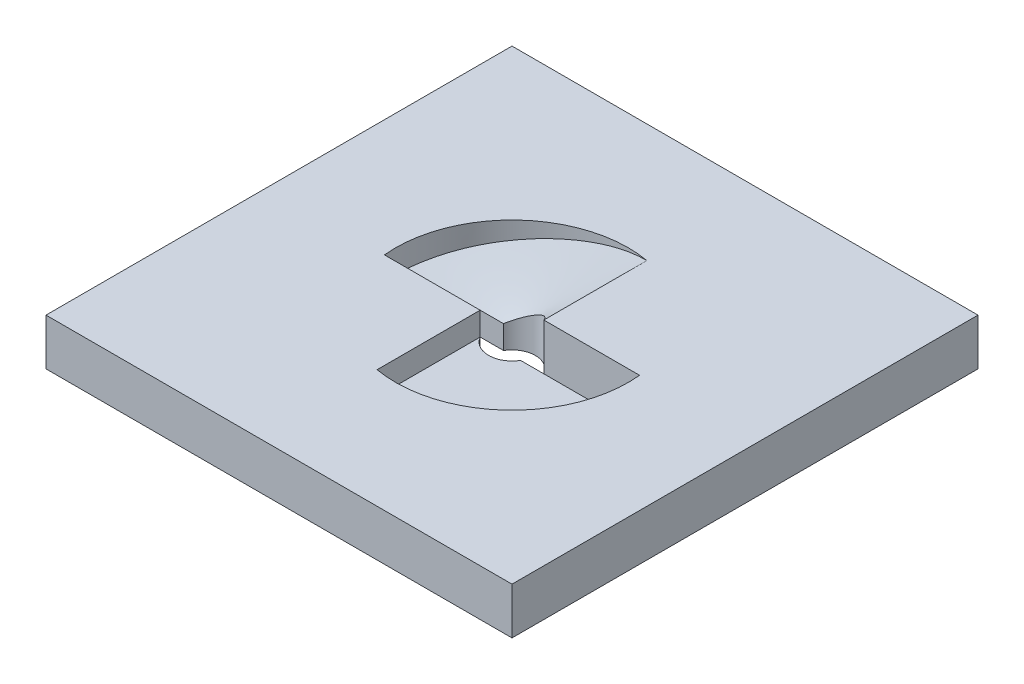
ISO-10303-21;
HEADER;
FILE_DESCRIPTION(('STEP AP214'),'2;1');
FILE_NAME('part.step','',(''),(''),'','','');
FILE_SCHEMA(('AUTOMOTIVE_DESIGN { 1 0 10303 214 1 1 1 1 }'));
ENDSEC;
DATA;
#1=APPLICATION_CONTEXT('core data for automotive mechanical design processes');
#2=APPLICATION_PROTOCOL_DEFINITION('international standard','automotive_design',2000,#1);
#3=PRODUCT_CONTEXT('',#1,'mechanical');
#4=PRODUCT('Part','Part','',(#3));
#5=PRODUCT_RELATED_PRODUCT_CATEGORY('part','',(#4));
#6=PRODUCT_DEFINITION_FORMATION('','',#4);
#7=PRODUCT_DEFINITION_CONTEXT('part definition',#1,'design');
#8=PRODUCT_DEFINITION('design','',#6,#7);
#9=PRODUCT_DEFINITION_SHAPE('','',#8);
#10=(LENGTH_UNIT() NAMED_UNIT(*) SI_UNIT(.MILLI.,.METRE.));
#11=(NAMED_UNIT(*) PLANE_ANGLE_UNIT() SI_UNIT($,.RADIAN.));
#12=(NAMED_UNIT(*) SI_UNIT($,.STERADIAN.) SOLID_ANGLE_UNIT());
#13=UNCERTAINTY_MEASURE_WITH_UNIT(LENGTH_MEASURE(1.E-05),#10,'distance_accuracy_value','');
#14=(GEOMETRIC_REPRESENTATION_CONTEXT(3) GLOBAL_UNCERTAINTY_ASSIGNED_CONTEXT((#13)) GLOBAL_UNIT_ASSIGNED_CONTEXT((#10,
#11,#12)) REPRESENTATION_CONTEXT('',''));
#15=CARTESIAN_POINT('',(0.,0.,0.));
#16=DIRECTION('',(0.,0.,1.));
#17=DIRECTION('',(1.,0.,0.));
#18=AXIS2_PLACEMENT_3D('',#15,#16,#17);
#19=CARTESIAN_POINT('',(24.8746859276655,0.,2.50000000000001));
#20=DIRECTION('',(0.,0.,1.));
#21=DIRECTION('',(1.,0.,0.));
#22=AXIS2_PLACEMENT_3D('',#19,#20,#21);
#23=PLANE('',#22);
#24=DIRECTION('',(-1.,0.,0.));
#25=VECTOR('',#24,1.);
#26=CARTESIAN_POINT('',(24.8746859276655,5.,2.50000000000001));
#27=LINE('',#26,#25);
#28=CARTESIAN_POINT('',(24.8746859276655,5.,2.50000000000001));
#29=VERTEX_POINT('',#28);
#30=CARTESIAN_POINT('',(4.33012701892221,5.,2.5));
#31=VERTEX_POINT('',#30);
#32=EDGE_CURVE('E264',#29,#31,#27,.T.);
#33=ORIENTED_EDGE('',*,*,#32,.F.);
#34=DIRECTION('',(0.,1.,0.));
#35=VECTOR('',#34,1.);
#36=CARTESIAN_POINT('',(24.8746859276655,0.,2.50000000000001));
#37=LINE('',#36,#35);
#38=CARTESIAN_POINT('',(24.8746859276655,0.,2.50000000000001));
#39=VERTEX_POINT('',#38);
#40=EDGE_CURVE('E309',#39,#29,#37,.T.);
#41=ORIENTED_EDGE('',*,*,#40,.F.);
#42=DIRECTION('',(1.,0.,0.));
#43=VECTOR('',#42,1.);
#44=CARTESIAN_POINT('',(24.8746859276655,0.,2.50000000000001));
#45=LINE('',#44,#43);
#46=CARTESIAN_POINT('',(4.33012701892221,0.,2.50000000000001));
#47=VERTEX_POINT('',#46);
#48=EDGE_CURVE('E300',#47,#39,#45,.T.);
#49=ORIENTED_EDGE('',*,*,#48,.F.);
#50=DIRECTION('',(0.,1.,0.));
#51=VECTOR('',#50,1.);
#52=CARTESIAN_POINT('',(4.33012701892221,0.,2.50000000000001));
#53=LINE('',#52,#51);
#54=EDGE_CURVE('E313',#47,#31,#53,.T.);
#55=ORIENTED_EDGE('',*,*,#54,.T.);
#56=EDGE_LOOP('',(#33,#41,#49,#55));
#57=FACE_BOUND('',#56,.T.);
#58=ADVANCED_FACE('F50',(#57),#23,.F.);
#59=CARTESIAN_POINT('',(0.,0.,0.));
#60=DIRECTION('',(0.,1.,0.));
#61=DIRECTION('',(0.,0.,1.));
#62=AXIS2_PLACEMENT_3D('',#59,#60,#61);
#63=CYLINDRICAL_SURFACE('',#62,5.);
#64=CARTESIAN_POINT('',(0.,5.,0.));
#65=DIRECTION('',(0.,1.,0.));
#66=DIRECTION('',(0.,0.,1.));
#67=AXIS2_PLACEMENT_3D('',#64,#65,#66);
#68=CIRCLE('',#67,5.);
#69=CARTESIAN_POINT('',(-4.33012701892218,5.,2.5));
#70=VERTEX_POINT('',#69);
#71=EDGE_CURVE('E12',#31,#70,#68,.F.);
#72=ORIENTED_EDGE('',*,*,#71,.F.);
#73=ORIENTED_EDGE('',*,*,#54,.F.);
#74=CARTESIAN_POINT('',(0.,0.,0.));
#75=DIRECTION('',(0.,1.,0.));
#76=DIRECTION('',(0.,0.,1.));
#77=AXIS2_PLACEMENT_3D('',#74,#75,#76);
#78=CIRCLE('',#77,5.);
#79=CARTESIAN_POINT('',(-4.33012701892218,0.,2.5));
#80=VERTEX_POINT('',#79);
#81=EDGE_CURVE('E297',#80,#47,#78,.T.);
#82=ORIENTED_EDGE('',*,*,#81,.F.);
#83=DIRECTION('',(0.,1.,0.));
#84=VECTOR('',#83,1.);
#85=CARTESIAN_POINT('',(-4.33012701892218,0.,2.5));
#86=LINE('',#85,#84);
#87=EDGE_CURVE('E316',#80,#70,#86,.T.);
#88=ORIENTED_EDGE('',*,*,#87,.T.);
#89=EDGE_LOOP('',(#72,#73,#82,#88));
#90=FACE_BOUND('',#89,.T.);
#91=ADVANCED_FACE('F476',(#90),#63,.F.);
#92=CARTESIAN_POINT('',(-4.33012701892218,0.,-2.49999999999999));
#93=DIRECTION('',(0.,0.,-1.));
#94=DIRECTION('',(-1.,0.,0.));
#95=AXIS2_PLACEMENT_3D('',#92,#93,#94);
#96=PLANE('',#95);
#97=DIRECTION('',(1.,0.,0.));
#98=VECTOR('',#97,1.);
#99=CARTESIAN_POINT('',(-24.8746859276655,5.,-2.49999999999999));
#100=LINE('',#99,#98);
#101=CARTESIAN_POINT('',(-24.8746859276655,5.,-2.49999999999999));
#102=VERTEX_POINT('',#101);
#103=CARTESIAN_POINT('',(-4.33012701892218,5.,-2.5));
#104=VERTEX_POINT('',#103);
#105=EDGE_CURVE('E190',#102,#104,#100,.T.);
#106=ORIENTED_EDGE('',*,*,#105,.F.);
#107=DIRECTION('',(0.,1.,0.));
#108=VECTOR('',#107,1.);
#109=CARTESIAN_POINT('',(-24.8746859276655,0.,-2.5));
#110=LINE('',#109,#108);
#111=CARTESIAN_POINT('',(-24.8746859276655,0.,-2.5));
#112=VERTEX_POINT('',#111);
#113=EDGE_CURVE('E321',#112,#102,#110,.T.);
#114=ORIENTED_EDGE('',*,*,#113,.F.);
#115=DIRECTION('',(-1.,0.,0.));
#116=VECTOR('',#115,1.);
#117=CARTESIAN_POINT('',(-4.33012701892218,0.,-2.49999999999999));
#118=LINE('',#117,#116);
#119=CARTESIAN_POINT('',(-4.33012701892218,0.,-2.49999999999999));
#120=VERTEX_POINT('',#119);
#121=EDGE_CURVE('E288',#120,#112,#118,.T.);
#122=ORIENTED_EDGE('',*,*,#121,.F.);
#123=DIRECTION('',(0.,1.,0.));
#124=VECTOR('',#123,1.);
#125=CARTESIAN_POINT('',(-4.33012701892218,0.,-2.49999999999999));
#126=LINE('',#125,#124);
#127=EDGE_CURVE('E396',#120,#104,#126,.T.);
#128=ORIENTED_EDGE('',*,*,#127,.T.);
#129=EDGE_LOOP('',(#106,#114,#122,#128));
#130=FACE_BOUND('',#129,.T.);
#131=ADVANCED_FACE('F375',(#130),#96,.F.);
#132=CARTESIAN_POINT('',(0.,0.,0.));
#133=DIRECTION('',(0.,1.,0.));
#134=DIRECTION('',(0.,0.,1.));
#135=AXIS2_PLACEMENT_3D('',#132,#133,#134);
#136=CYLINDRICAL_SURFACE('',#135,5.);
#137=DIRECTION('',(0.,1.,0.));
#138=VECTOR('',#137,1.);
#139=CARTESIAN_POINT('',(4.33012701892221,0.,-2.49999999999999));
#140=LINE('',#139,#138);
#141=CARTESIAN_POINT('',(4.33012701892221,0.,-2.49999999999999));
#142=VERTEX_POINT('',#141);
#143=CARTESIAN_POINT('',(4.3301270189222,10.,-2.5));
#144=VERTEX_POINT('',#143);
#145=EDGE_CURVE('E324',#142,#144,#140,.T.);
#146=ORIENTED_EDGE('',*,*,#145,.T.);
#147=CARTESIAN_POINT('',(2.66469387697522,9.03846172717959,-4.23076902489497));
#148=CARTESIAN_POINT('',(2.71201647111971,9.06578423095411,-4.20096695407878));
#149=CARTESIAN_POINT('',(2.75893505235169,9.092877795628,-4.17030890265555));
#150=CARTESIAN_POINT('',(2.8597173059455,9.15108161608739,-4.10199762314281));
#151=CARTESIAN_POINT('',(2.91342322156642,9.18210181302127,-4.06403461143927));
#152=CARTESIAN_POINT('',(3.02674133506856,9.24755699590658,-3.98051404339117));
#153=CARTESIAN_POINT('',(3.08616948339993,9.28188613031832,-3.93462390698361));
#154=CARTESIAN_POINT('',(3.22702578685333,9.3632492322429,-3.82066271475998));
#155=CARTESIAN_POINT('',(3.30758799677962,9.40978150048858,-3.75115172965387));
#156=CARTESIAN_POINT('',(3.43495058831338,9.48333598194429,-3.633934591223));
#157=CARTESIAN_POINT('',(3.48295783993006,9.5110588513575,-3.58796805872294));
#158=CARTESIAN_POINT('',(3.55013771851769,9.54984615250141,-3.52100587889694));
#159=CARTESIAN_POINT('',(3.56997338562836,9.56129764331009,-3.50089667312357));
#160=CARTESIAN_POINT('',(3.63946173080064,9.60140094932761,-3.42913563629135));
#161=CARTESIAN_POINT('',(3.68824865042857,9.62953214992196,-3.37634819292174));
#162=CARTESIAN_POINT('',(3.78274073221074,9.68403932733123,-3.26978154282066));
#163=CARTESIAN_POINT('',(3.82849161262608,9.71044114783264,-3.21605587466706));
#164=CARTESIAN_POINT('',(3.91686100254527,9.76143870251643,-3.10775101677127));
#165=CARTESIAN_POINT('',(3.95952898133712,9.78606294637963,-3.05322573432534));
#166=CARTESIAN_POINT('',(4.04175793844594,9.83352346540376,-2.9435814290528));
#167=CARTESIAN_POINT('',(4.08137069862592,9.85638949228409,-2.88851410474692));
#168=CARTESIAN_POINT('',(4.1574960432594,9.90033457994804,-2.77801361779177));
#169=CARTESIAN_POINT('',(4.19406359905576,9.92144530238931,-2.7226309826546));
#170=CARTESIAN_POINT('',(4.26410386043743,9.96188147346823,-2.61173440486431));
#171=CARTESIAN_POINT('',(4.29763526663986,9.98124077005096,-2.55626984469197));
#172=CARTESIAN_POINT('',(4.3301270189222,10.,-2.5));
#173=B_SPLINE_CURVE_WITH_KNOTS('',3,(#147,#148,#149,#150,#151,#152,#153,#154,#155,#156,#157,
#158,#159,#160,#161,#162,#163,#164,#165,#166,#167,#168,#169,#170,#171,#172),.UNSPECIFIED.,.F.,
.F.,(4,2,2,2,2,2,2,2,2,2,2,2,4),(0.,0.186723859821849,0.404823721043762,0.652433105686789,
1.00059122715136,1.21658325383816,1.30801676960532,1.53949876069109,1.76546925532878,
1.98585519864352,2.2005496365362,2.40941488775197,2.61228596922703),.UNSPECIFIED.);
#174=CARTESIAN_POINT('',(2.66469387697523,9.03846172717959,-4.23076902489498));
#175=VERTEX_POINT('',#174);
#176=EDGE_CURVE('E410',#144,#175,#173,.F.);
#177=ORIENTED_EDGE('',*,*,#176,.T.);
#178=CARTESIAN_POINT('',(0.,7.50000000000005,-4.99999999999999));
#179=CARTESIAN_POINT('',(0.077641100800136,7.54502894051611,-5.00038153963472));
#180=CARTESIAN_POINT('',(0.155295529280746,7.59004357796572,-4.99880806099145));
#181=CARTESIAN_POINT('',(0.310330057872768,7.67987279883182,-4.99184724183534));
#182=CARTESIAN_POINT('',(0.387710390770706,7.72468760401123,-4.98646797835986));
#183=CARTESIAN_POINT('',(0.541989321639058,7.81400020812547,-4.97201473445265));
#184=CARTESIAN_POINT('',(0.618888669131687,7.85849855732807,-4.96295209775802));
#185=CARTESIAN_POINT('',(0.772000011672761,7.94706319612295,-4.94124937814224));
#186=CARTESIAN_POINT('',(0.848213534083741,7.99113051144209,-4.92862424309555));
#187=CARTESIAN_POINT('',(0.999745913193733,8.07871467555184,-4.8999086547921));
#188=CARTESIAN_POINT('',(1.07506737372214,8.12223320682186,-4.88383704809309));
#189=CARTESIAN_POINT('',(1.2246089688976,8.20861136482232,-4.84836291279009));
#190=CARTESIAN_POINT('',(1.29883309563468,8.25147344810793,-4.82898321639336));
#191=CARTESIAN_POINT('',(1.44282080113774,8.33457599270169,-4.78784389737535));
#192=CARTESIAN_POINT('',(1.51261988151526,8.37483927480482,-4.76625454776219));
#193=CARTESIAN_POINT('',(1.65631883637297,8.45768304476946,-4.71832205829275));
#194=CARTESIAN_POINT('',(1.73016351639815,8.5002283096562,-4.69175186940232));
#195=CARTESIAN_POINT('',(1.88132949025462,8.58728354323841,-4.63328965621397));
#196=CARTESIAN_POINT('',(1.95858586812472,8.63175375747104,-4.60117104398461));
#197=CARTESIAN_POINT('',(2.13825702945594,8.73517794874509,-4.52115621622071));
#198=CARTESIAN_POINT('',(2.24013653484664,8.79382454072771,-4.47164407224014));
#199=CARTESIAN_POINT('',(2.41018234330231,8.89174921377044,-4.38161505801643));
#200=CARTESIAN_POINT('',(2.47911123522496,8.93145451351053,-4.34299220879572));
#201=CARTESIAN_POINT('',(2.58666657572019,8.99345313108483,-4.27925364549009));
#202=CARTESIAN_POINT('',(2.62582182820688,9.01603284456828,-4.2553048612224));
#203=CARTESIAN_POINT('',(2.66469387697522,9.03846172717959,-4.23076902489497));
#204=B_SPLINE_CURVE_WITH_KNOTS('',3,(#178,#179,#180,#181,#182,#183,#184,#185,#186,#187,#188,
#189,#190,#191,#192,#193,#194,#195,#196,#197,#198,#199,#200,#201,#202,#203),.UNSPECIFIED.,.F.,
.F.,(4,2,2,2,2,2,2,2,2,2,2,2,4),(0.,0.269236793043977,0.537903890866714,0.805749765856512,
1.07248808500348,1.33780337406321,1.60135649838329,1.85155989019279,2.11928786225258,
2.40345378397335,2.78585330859412,3.05105113546076,3.20449084127191),.UNSPECIFIED.);
#205=CARTESIAN_POINT('',(1.04614118198666E-13,7.50000000000005,-4.99999999999998));
#206=VERTEX_POINT('',#205);
#207=EDGE_CURVE('E179',#175,#206,#204,.F.);
#208=ORIENTED_EDGE('',*,*,#207,.T.);
#209=CARTESIAN_POINT('',(-2.66469381987522,5.9615383057871,-4.23076906085864));
#210=CARTESIAN_POINT('',(-2.62213431714754,5.98613608600261,-4.25761986270339));
#211=CARTESIAN_POINT('',(-2.57925296980721,6.01094995302502,-4.283762117572));
#212=CARTESIAN_POINT('',(-2.46812867054903,6.07530315274656,-4.3492118770725));
#213=CARTESIAN_POINT('',(-2.39943669491506,6.11513076700339,-4.38747699474603));
#214=CARTESIAN_POINT('',(-2.23418811284831,6.2109558430761,-4.47446963200018));
#215=CARTESIAN_POINT('',(-2.13700776561904,6.26732026999614,-4.52161247615482));
#216=CARTESIAN_POINT('',(-1.93764397772006,6.38290919804302,-4.61059488507811));
#217=CARTESIAN_POINT('',(-1.83539688150126,6.44216943067565,-4.65224504626992));
#218=CARTESIAN_POINT('',(-1.65802621570108,6.5448927599221,-4.71788697321277));
#219=CARTESIAN_POINT('',(-1.58337228699147,6.58810532216619,-4.74354862555331));
#220=CARTESIAN_POINT('',(-1.46369041026877,6.65721011719926,-4.78137530636382));
#221=CARTESIAN_POINT('',(-1.41898514884564,6.68298551543887,-4.79477928241667));
#222=CARTESIAN_POINT('',(-1.30014920774479,6.75135126983072,-4.82840104108803));
#223=CARTESIAN_POINT('',(-1.2257181827732,6.79401719794146,-4.84740748775672));
#224=CARTESIAN_POINT('',(-1.07588177626303,6.88005628966388,-4.88237884327327));
#225=CARTESIAN_POINT('',(-1.00047320600035,6.92343225775203,-4.89832295756074));
#226=CARTESIAN_POINT('',(-0.848779004472191,7.01070990764246,-4.9268617464752));
#227=CARTESIAN_POINT('',(-0.772490845324808,7.05461315535053,-4.93943832309776));
#228=CARTESIAN_POINT('',(-0.619256159008456,7.14284960312159,-4.96117134866003));
#229=CARTESIAN_POINT('',(-0.542308215558828,7.18718382668418,-4.97031362797632));
#230=CARTESIAN_POINT('',(-0.387939076444063,7.27616355101148,-4.98504425202584));
#231=CARTESIAN_POINT('',(-0.31051715342356,7.32080958714814,-4.99062180843157));
#232=CARTESIAN_POINT('',(-0.155395474246203,7.41029864888932,-4.99810195399945));
#233=CARTESIAN_POINT('',(-0.0776954750243295,7.45514189104159,-4.99999688604764));
#234=CARTESIAN_POINT('',(0.,7.50000000000005,-4.99999999999999));
#235=B_SPLINE_CURVE_WITH_KNOTS('',3,(#209,#210,#211,#212,#213,#214,#215,#216,#217,#218,#219,
#220,#221,#222,#223,#224,#225,#226,#227,#228,#229,#230,#231,#232,#233,#234),.UNSPECIFIED.,.F.,
.F.,(4,2,2,2,2,2,2,2,2,2,2,2,4),(0.,0.168030749987248,0.432371274701487,0.797654862639586,
1.17334758541931,1.44325043639105,1.60318065349655,1.86671988575498,2.13198986977316,
2.39865810135086,2.66641480468773,2.93497806069148,3.20409913316667),.UNSPECIFIED.);
#236=CARTESIAN_POINT('',(-2.66469381987522,5.9615383057871,-4.23076906085864));
#237=VERTEX_POINT('',#236);
#238=EDGE_CURVE('E171',#206,#237,#235,.F.);
#239=ORIENTED_EDGE('',*,*,#238,.T.);
#240=CARTESIAN_POINT('',(-4.33012701892218,5.,-2.49999999999999));
#241=CARTESIAN_POINT('',(-4.31365030625631,5.00952663961418,-2.52857886251552));
#242=CARTESIAN_POINT('',(-4.29690831611142,5.01921085126962,-2.55695220826712));
#243=CARTESIAN_POINT('',(-4.24442463925422,5.04957778314617,-2.64390087488356));
#244=CARTESIAN_POINT('',(-4.20781470637679,5.07077181089878,-2.70177595862716));
#245=CARTESIAN_POINT('',(-4.11115869879348,5.12672321074072,-2.84784307209986));
#246=CARTESIAN_POINT('',(-4.04956482953202,5.16237425922557,-2.9346756634256));
#247=CARTESIAN_POINT('',(-3.93205261887673,5.23037006348812,-3.08978327608383));
#248=CARTESIAN_POINT('',(-3.87684308277111,5.26230801669546,-3.1587778651518));
#249=CARTESIAN_POINT('',(-3.77600536240032,5.32060934453382,-3.27824560280895));
#250=CARTESIAN_POINT('',(-3.73099436215711,5.3466228178133,-3.32941122543735));
#251=CARTESIAN_POINT('',(-3.65341173708673,5.39140213299435,-3.41399151225074));
#252=CARTESIAN_POINT('',(-3.62131854438577,5.40990963165503,-3.44798375040561));
#253=CARTESIAN_POINT('',(-3.54411935844089,5.4543910900212,-3.52743973986551));
#254=CARTESIAN_POINT('',(-3.49864169135794,5.48056524385189,-3.57243146569054));
#255=CARTESIAN_POINT('',(-3.40538875052721,5.53427249052329,-3.66133072535676));
#256=CARTESIAN_POINT('',(-3.35758580499411,5.56182223438997,-3.70519910602332));
#257=CARTESIAN_POINT('',(-3.25964417850128,5.61827700215986,-3.79167515915462));
#258=CARTESIAN_POINT('',(-3.20947810102794,5.64719799416823,-3.8342413971618));
#259=CARTESIAN_POINT('',(-3.1068115204465,5.70640128152455,-3.91796694743798));
#260=CARTESIAN_POINT('',(-3.05428460049113,5.736699107307,-3.95908287000531));
#261=CARTESIAN_POINT('',(-2.94688680626773,5.79865935194772,-4.03975317898719));
#262=CARTESIAN_POINT('',(-2.89199022401474,5.83033684368137,-4.07926175269222));
#263=CARTESIAN_POINT('',(-2.77984620481831,5.89506041977192,-4.15656694937576));
#264=CARTESIAN_POINT('',(-2.72257379642875,5.92812114898806,-4.19431510065001));
#265=CARTESIAN_POINT('',(-2.66469381987522,5.9615383057871,-4.23076906085864));
#266=B_SPLINE_CURVE_WITH_KNOTS('',3,(#240,#241,#242,#243,#244,#245,#246,#247,#248,#249,#250,
#251,#252,#253,#254,#255,#256,#257,#258,#259,#260,#261,#262,#263,#264,#265),.UNSPECIFIED.,.F.,
.F.,(4,2,2,2,2,2,2,2,2,2,2,2,4),(0.,0.103007904803155,0.318000838307776,0.654546475323781,
0.93629529410469,1.15505878005877,1.30587736173679,1.51318491099862,1.72460059331123,
1.9401509444506,2.15988826425376,2.38389158635733,2.61226748486241),.UNSPECIFIED.);
#267=EDGE_CURVE('E175',#237,#104,#266,.F.);
#268=ORIENTED_EDGE('',*,*,#267,.T.);
#269=ORIENTED_EDGE('',*,*,#127,.F.);
#270=CARTESIAN_POINT('',(0.,0.,0.));
#271=DIRECTION('',(0.,1.,0.));
#272=DIRECTION('',(0.,0.,1.));
#273=AXIS2_PLACEMENT_3D('',#270,#271,#272);
#274=CIRCLE('',#273,5.);
#275=EDGE_CURVE('E285',#142,#120,#274,.T.);
#276=ORIENTED_EDGE('',*,*,#275,.F.);
#277=EDGE_LOOP('',(#146,#177,#208,#239,#268,#269,#276));
#278=FACE_BOUND('',#277,.T.);
#279=ADVANCED_FACE('F174',(#278),#136,.F.);
#280=CARTESIAN_POINT('',(50.,10.,50.));
#281=DIRECTION('',(-1.,0.,0.));
#282=DIRECTION('',(0.,0.,1.));
#283=AXIS2_PLACEMENT_3D('',#280,#281,#282);
#284=PLANE('',#283);
#285=DIRECTION('',(0.,0.,-1.));
#286=VECTOR('',#285,1.);
#287=CARTESIAN_POINT('',(50.,0.,50.));
#288=LINE('',#287,#286);
#289=CARTESIAN_POINT('',(50.,0.,50.));
#290=VERTEX_POINT('',#289);
#291=CARTESIAN_POINT('',(50.,0.,-50.));
#292=VERTEX_POINT('',#291);
#293=EDGE_CURVE('E312',#290,#292,#288,.T.);
#294=ORIENTED_EDGE('',*,*,#293,.T.);
#295=DIRECTION('',(0.,-1.,0.));
#296=VECTOR('',#295,1.);
#297=CARTESIAN_POINT('',(50.,10.,-50.));
#298=LINE('',#297,#296);
#299=CARTESIAN_POINT('',(50.,10.,-50.));
#300=VERTEX_POINT('',#299);
#301=EDGE_CURVE('E59',#300,#292,#298,.T.);
#302=ORIENTED_EDGE('',*,*,#301,.F.);
#303=DIRECTION('',(0.,0.,-1.));
#304=VECTOR('',#303,1.);
#305=CARTESIAN_POINT('',(50.,10.,50.));
#306=LINE('',#305,#304);
#307=CARTESIAN_POINT('',(50.,10.,50.));
#308=VERTEX_POINT('',#307);
#309=EDGE_CURVE('E325',#308,#300,#306,.T.);
#310=ORIENTED_EDGE('',*,*,#309,.F.);
#311=DIRECTION('',(0.,-1.,0.));
#312=VECTOR('',#311,1.);
#313=CARTESIAN_POINT('',(50.,10.,50.));
#314=LINE('',#313,#312);
#315=EDGE_CURVE('E335',#308,#290,#314,.T.);
#316=ORIENTED_EDGE('',*,*,#315,.T.);
#317=EDGE_LOOP('',(#294,#302,#310,#316));
#318=FACE_BOUND('',#317,.T.);
#319=ADVANCED_FACE('F52',(#318),#284,.F.);
#320=CARTESIAN_POINT('',(50.,10.,-50.));
#321=DIRECTION('',(0.,0.,1.));
#322=DIRECTION('',(1.,0.,0.));
#323=AXIS2_PLACEMENT_3D('',#320,#321,#322);
#324=PLANE('',#323);
#325=DIRECTION('',(-1.,0.,0.));
#326=VECTOR('',#325,1.);
#327=CARTESIAN_POINT('',(50.,0.,-50.));
#328=LINE('',#327,#326);
#329=CARTESIAN_POINT('',(-50.,0.,-50.));
#330=VERTEX_POINT('',#329);
#331=EDGE_CURVE('E338',#292,#330,#328,.T.);
#332=ORIENTED_EDGE('',*,*,#331,.T.);
#333=DIRECTION('',(0.,-1.,0.));
#334=VECTOR('',#333,1.);
#335=CARTESIAN_POINT('',(-50.,10.,-50.));
#336=LINE('',#335,#334);
#337=CARTESIAN_POINT('',(-50.,10.,-50.));
#338=VERTEX_POINT('',#337);
#339=EDGE_CURVE('E348',#338,#330,#336,.T.);
#340=ORIENTED_EDGE('',*,*,#339,.F.);
#341=DIRECTION('',(-1.,0.,0.));
#342=VECTOR('',#341,1.);
#343=CARTESIAN_POINT('',(50.,10.,-50.));
#344=LINE('',#343,#342);
#345=EDGE_CURVE('E328',#300,#338,#344,.T.);
#346=ORIENTED_EDGE('',*,*,#345,.F.);
#347=ORIENTED_EDGE('',*,*,#301,.T.);
#348=EDGE_LOOP('',(#332,#340,#346,#347));
#349=FACE_BOUND('',#348,.T.);
#350=ADVANCED_FACE('F467',(#349),#324,.F.);
#351=CARTESIAN_POINT('',(-50.,10.,50.));
#352=DIRECTION('',(1.,0.,0.));
#353=DIRECTION('',(0.,0.,-1.));
#354=AXIS2_PLACEMENT_3D('',#351,#352,#353);
#355=PLANE('',#354);
#356=DIRECTION('',(0.,0.,1.));
#357=VECTOR('',#356,1.);
#358=CARTESIAN_POINT('',(-50.,0.,50.));
#359=LINE('',#358,#357);
#360=CARTESIAN_POINT('',(-50.,0.,50.));
#361=VERTEX_POINT('',#360);
#362=EDGE_CURVE('E340',#330,#361,#359,.T.);
#363=ORIENTED_EDGE('',*,*,#362,.T.);
#364=DIRECTION('',(0.,-1.,0.));
#365=VECTOR('',#364,1.);
#366=CARTESIAN_POINT('',(-50.,10.,50.));
#367=LINE('',#366,#365);
#368=CARTESIAN_POINT('',(-50.,10.,50.));
#369=VERTEX_POINT('',#368);
#370=EDGE_CURVE('E345',#369,#361,#367,.T.);
#371=ORIENTED_EDGE('',*,*,#370,.F.);
#372=DIRECTION('',(0.,0.,1.));
#373=VECTOR('',#372,1.);
#374=CARTESIAN_POINT('',(-50.,10.,50.));
#375=LINE('',#374,#373);
#376=EDGE_CURVE('E331',#338,#369,#375,.T.);
#377=ORIENTED_EDGE('',*,*,#376,.F.);
#378=ORIENTED_EDGE('',*,*,#339,.T.);
#379=EDGE_LOOP('',(#363,#371,#377,#378));
#380=FACE_BOUND('',#379,.T.);
#381=ADVANCED_FACE('F464',(#380),#355,.F.);
#382=CARTESIAN_POINT('',(50.,10.,50.));
#383=DIRECTION('',(0.,0.,-1.));
#384=DIRECTION('',(-1.,0.,0.));
#385=AXIS2_PLACEMENT_3D('',#382,#383,#384);
#386=PLANE('',#385);
#387=DIRECTION('',(1.,0.,0.));
#388=VECTOR('',#387,1.);
#389=CARTESIAN_POINT('',(50.,0.,50.));
#390=LINE('',#389,#388);
#391=EDGE_CURVE('E329',#361,#290,#390,.T.);
#392=ORIENTED_EDGE('',*,*,#391,.T.);
#393=ORIENTED_EDGE('',*,*,#315,.F.);
#394=DIRECTION('',(1.,0.,0.));
#395=VECTOR('',#394,1.);
#396=CARTESIAN_POINT('',(50.,10.,50.));
#397=LINE('',#396,#395);
#398=EDGE_CURVE('E333',#369,#308,#397,.T.);
#399=ORIENTED_EDGE('',*,*,#398,.F.);
#400=ORIENTED_EDGE('',*,*,#370,.T.);
#401=EDGE_LOOP('',(#392,#393,#399,#400));
#402=FACE_BOUND('',#401,.T.);
#403=ADVANCED_FACE('F457',(#402),#386,.F.);
#404=CARTESIAN_POINT('',(0.,10.,0.));
#405=DIRECTION('',(0.,1.,0.));
#406=DIRECTION('',(0.,0.,1.));
#407=AXIS2_PLACEMENT_3D('',#404,#405,#406);
#408=PLANE('',#407);
#409=CARTESIAN_POINT('',(0.,10.,0.));
#410=DIRECTION('',(0.,1.,0.));
#411=DIRECTION('',(0.,0.,1.));
#412=AXIS2_PLACEMENT_3D('',#409,#410,#411);
#413=CIRCLE('',#412,25.);
#414=CARTESIAN_POINT('',(-4.33012701892218,10.,24.6221445044903));
#415=VERTEX_POINT('',#414);
#416=CARTESIAN_POINT('',(24.8746859276655,10.,-2.49999999999999));
#417=VERTEX_POINT('',#416);
#418=EDGE_CURVE('E276',#415,#417,#413,.T.);
#419=ORIENTED_EDGE('',*,*,#418,.F.);
#420=DIRECTION('',(0.,0.,1.));
#421=VECTOR('',#420,1.);
#422=CARTESIAN_POINT('',(-4.33012701892219,10.,2.5));
#423=LINE('',#422,#421);
#424=CARTESIAN_POINT('',(-4.33012701892219,10.,2.5));
#425=VERTEX_POINT('',#424);
#426=EDGE_CURVE('E265',#425,#415,#423,.T.);
#427=ORIENTED_EDGE('',*,*,#426,.F.);
#428=DIRECTION('',(1.,0.,0.));
#429=VECTOR('',#428,1.);
#430=CARTESIAN_POINT('',(-4.33012701892218,10.,2.50000000000001));
#431=LINE('',#430,#429);
#432=CARTESIAN_POINT('',(-24.8746859276655,10.,2.50000000000001));
#433=VERTEX_POINT('',#432);
#434=EDGE_CURVE('E282',#433,#425,#431,.T.);
#435=ORIENTED_EDGE('',*,*,#434,.F.);
#436=CARTESIAN_POINT('',(0.,10.,0.));
#437=DIRECTION('',(0.,1.,0.));
#438=DIRECTION('',(0.,0.,1.));
#439=AXIS2_PLACEMENT_3D('',#436,#437,#438);
#440=CIRCLE('',#439,25.);
#441=CARTESIAN_POINT('',(4.3301270189222,10.,-24.6221445044903));
#442=VERTEX_POINT('',#441);
#443=EDGE_CURVE('E308',#442,#433,#440,.T.);
#444=ORIENTED_EDGE('',*,*,#443,.F.);
#445=DIRECTION('',(0.,0.,-1.));
#446=VECTOR('',#445,1.);
#447=CARTESIAN_POINT('',(4.33012701892221,10.,-2.49999999999999));
#448=LINE('',#447,#446);
#449=EDGE_CURVE('E509',#144,#442,#448,.T.);
#450=ORIENTED_EDGE('',*,*,#449,.F.);
#451=DIRECTION('',(-1.,0.,0.));
#452=VECTOR('',#451,1.);
#453=CARTESIAN_POINT('',(24.8746859276655,10.,-2.49999999999999));
#454=LINE('',#453,#452);
#455=EDGE_CURVE('E305',#417,#144,#454,.T.);
#456=ORIENTED_EDGE('',*,*,#455,.F.);
#457=EDGE_LOOP('',(#419,#427,#435,#444,#450,#456));
#458=FACE_BOUND('',#457,.T.);
#459=ORIENTED_EDGE('',*,*,#309,.T.);
#460=ORIENTED_EDGE('',*,*,#345,.T.);
#461=ORIENTED_EDGE('',*,*,#376,.T.);
#462=ORIENTED_EDGE('',*,*,#398,.T.);
#463=EDGE_LOOP('',(#459,#460,#461,#462));
#464=FACE_BOUND('',#463,.T.);
#465=ADVANCED_FACE('F454',(#458,#464),#408,.T.);
#466=CARTESIAN_POINT('',(0.,0.,0.));
#467=DIRECTION('',(0.,1.,0.));
#468=DIRECTION('',(0.,0.,1.));
#469=AXIS2_PLACEMENT_3D('',#466,#467,#468);
#470=PLANE('',#469);
#471=ORIENTED_EDGE('',*,*,#48,.T.);
#472=CARTESIAN_POINT('',(0.,0.,0.));
#473=DIRECTION('',(0.,1.,0.));
#474=DIRECTION('',(0.,0.,1.));
#475=AXIS2_PLACEMENT_3D('',#472,#473,#474);
#476=CIRCLE('',#475,25.);
#477=CARTESIAN_POINT('',(24.8746859276655,0.,-2.49999999999999));
#478=VERTEX_POINT('',#477);
#479=EDGE_CURVE('E278',#39,#478,#476,.T.);
#480=ORIENTED_EDGE('',*,*,#479,.T.);
#481=DIRECTION('',(-1.,0.,0.));
#482=VECTOR('',#481,1.);
#483=CARTESIAN_POINT('',(24.8746859276655,0.,-2.49999999999999));
#484=LINE('',#483,#482);
#485=EDGE_CURVE('E281',#478,#142,#484,.T.);
#486=ORIENTED_EDGE('',*,*,#485,.T.);
#487=ORIENTED_EDGE('',*,*,#275,.T.);
#488=ORIENTED_EDGE('',*,*,#121,.T.);
#489=CARTESIAN_POINT('',(0.,0.,0.));
#490=DIRECTION('',(0.,1.,0.));
#491=DIRECTION('',(0.,0.,1.));
#492=AXIS2_PLACEMENT_3D('',#489,#490,#491);
#493=CIRCLE('',#492,25.);
#494=CARTESIAN_POINT('',(-24.8746859276655,0.,2.50000000000001));
#495=VERTEX_POINT('',#494);
#496=EDGE_CURVE('E291',#112,#495,#493,.T.);
#497=ORIENTED_EDGE('',*,*,#496,.T.);
#498=DIRECTION('',(1.,0.,0.));
#499=VECTOR('',#498,1.);
#500=CARTESIAN_POINT('',(-4.33012701892218,0.,2.50000000000001));
#501=LINE('',#500,#499);
#502=EDGE_CURVE('E294',#495,#80,#501,.T.);
#503=ORIENTED_EDGE('',*,*,#502,.T.);
#504=ORIENTED_EDGE('',*,*,#81,.T.);
#505=EDGE_LOOP('',(#471,#480,#486,#487,#488,#497,#503,#504));
#506=FACE_BOUND('',#505,.T.);
#507=ORIENTED_EDGE('',*,*,#293,.F.);
#508=ORIENTED_EDGE('',*,*,#391,.F.);
#509=ORIENTED_EDGE('',*,*,#362,.F.);
#510=ORIENTED_EDGE('',*,*,#331,.F.);
#511=EDGE_LOOP('',(#507,#508,#509,#510));
#512=FACE_BOUND('',#511,.T.);
#513=ADVANCED_FACE('F452',(#506,#512),#470,.F.);
#514=CARTESIAN_POINT('',(0.,0.,0.));
#515=DIRECTION('',(0.,1.,0.));
#516=DIRECTION('',(0.,0.,1.));
#517=AXIS2_PLACEMENT_3D('',#514,#515,#516);
#518=CYLINDRICAL_SURFACE('',#517,25.);
#519=ORIENTED_EDGE('',*,*,#418,.T.);
#520=DIRECTION('',(0.,1.,0.));
#521=VECTOR('',#520,1.);
#522=CARTESIAN_POINT('',(24.8746859276655,0.,-2.49999999999999));
#523=LINE('',#522,#521);
#524=EDGE_CURVE('E303',#478,#417,#523,.T.);
#525=ORIENTED_EDGE('',*,*,#524,.F.);
#526=ORIENTED_EDGE('',*,*,#479,.F.);
#527=ORIENTED_EDGE('',*,*,#40,.T.);
#528=CARTESIAN_POINT('',(0.,5.,0.));
#529=DIRECTION('',(0.,1.,0.));
#530=DIRECTION('',(0.,0.,1.));
#531=AXIS2_PLACEMENT_3D('',#528,#529,#530);
#532=CIRCLE('',#531,25.);
#533=CARTESIAN_POINT('',(-4.33012701892218,5.,24.6221445044903));
#534=VERTEX_POINT('',#533);
#535=EDGE_CURVE('E257',#534,#29,#532,.T.);
#536=ORIENTED_EDGE('',*,*,#535,.F.);
#537=DIRECTION('',(0.,1.,0.));
#538=VECTOR('',#537,1.);
#539=CARTESIAN_POINT('',(-4.33012701892218,5.,24.6221445044903));
#540=LINE('',#539,#538);
#541=EDGE_CURVE('E273',#534,#415,#540,.T.);
#542=ORIENTED_EDGE('',*,*,#541,.T.);
#543=EDGE_LOOP('',(#519,#525,#526,#527,#536,#542));
#544=FACE_BOUND('',#543,.T.);
#545=ADVANCED_FACE('F449',(#544),#518,.F.);
#546=CARTESIAN_POINT('',(-4.33012701892218,0.,2.50000000000001));
#547=DIRECTION('',(0.,0.,1.));
#548=DIRECTION('',(1.,0.,0.));
#549=AXIS2_PLACEMENT_3D('',#546,#547,#548);
#550=PLANE('',#549);
#551=ORIENTED_EDGE('',*,*,#434,.T.);
#552=DIRECTION('',(0.,1.,0.));
#553=VECTOR('',#552,1.);
#554=CARTESIAN_POINT('',(-4.33012701892219,5.,2.5));
#555=LINE('',#554,#553);
#556=EDGE_CURVE('E270',#70,#425,#555,.T.);
#557=ORIENTED_EDGE('',*,*,#556,.F.);
#558=ORIENTED_EDGE('',*,*,#87,.F.);
#559=ORIENTED_EDGE('',*,*,#502,.F.);
#560=DIRECTION('',(0.,1.,0.));
#561=VECTOR('',#560,1.);
#562=CARTESIAN_POINT('',(-24.8746859276655,0.,2.50000000000001));
#563=LINE('',#562,#561);
#564=EDGE_CURVE('E319',#495,#433,#563,.T.);
#565=ORIENTED_EDGE('',*,*,#564,.T.);
#566=EDGE_LOOP('',(#551,#557,#558,#559,#565));
#567=FACE_BOUND('',#566,.T.);
#568=ADVANCED_FACE('F373',(#567),#550,.F.);
#569=CARTESIAN_POINT('',(0.,0.,0.));
#570=DIRECTION('',(0.,1.,0.));
#571=DIRECTION('',(0.,0.,1.));
#572=AXIS2_PLACEMENT_3D('',#569,#570,#571);
#573=CYLINDRICAL_SURFACE('',#572,25.);
#574=ORIENTED_EDGE('',*,*,#113,.T.);
#575=CARTESIAN_POINT('',(4.3301270189222,10.,-24.6221445044903));
#576=CARTESIAN_POINT('',(1.32314317407007,9.48519036051497,-25.1509620487818));
#577=CARTESIAN_POINT('',(-2.04441072821273,8.90864944781649,-25.1565593822649));
#578=CARTESIAN_POINT('',(-8.81623571249382,7.7492814702393,-23.6496529158633));
#579=CARTESIAN_POINT('',(-12.1988192251611,7.1701674182415,-22.122203423978));
#580=CARTESIAN_POINT('',(-17.9917120426449,6.17839718706789,-17.7341865501231));
#581=CARTESIAN_POINT('',(-20.3781681373674,5.76982478855826,-14.891687565358));
#582=CARTESIAN_POINT('',(-23.6627418027322,5.20749047890665,-8.78104467340225));
#583=CARTESIAN_POINT('',(-24.5693729761166,5.05227099932249,-5.53782551177134));
#584=CARTESIAN_POINT('',(-24.8746859276655,5.,-2.50000000000002));
#585=B_SPLINE_CURVE_WITH_KNOTS('',3,(#575,#576,#577,#578,#579,#580,#581,#582,#583,#584),
.UNSPECIFIED.,.F.,.F.,(4,2,2,2,4),(0.,0.25,0.5,0.75,1.),.UNSPECIFIED.);
#586=CARTESIAN_POINT('',(-22.0204551093149,5.48865760988961,-11.8363658602902));
#587=VERTEX_POINT('',#586);
#588=EDGE_CURVE('E192',#102,#587,#585,.F.);
#589=ORIENTED_EDGE('',*,*,#588,.T.);
#590=CARTESIAN_POINT('',(4.3301270189222,10.,-24.6221445044903));
#591=CARTESIAN_POINT('',(1.32314317407007,9.48519036051497,-25.1509620487818));
#592=CARTESIAN_POINT('',(-2.04441072821273,8.90864944781649,-25.1565593822649));
#593=CARTESIAN_POINT('',(-8.81623571249382,7.7492814702393,-23.6496529158633));
#594=CARTESIAN_POINT('',(-12.1988192251611,7.1701674182415,-22.122203423978));
#595=CARTESIAN_POINT('',(-17.9917120426449,6.17839718706789,-17.7341865501231));
#596=CARTESIAN_POINT('',(-20.3781681373674,5.76982478855826,-14.891687565358));
#597=CARTESIAN_POINT('',(-23.6627418027322,5.20749047890665,-8.78104467340225));
#598=CARTESIAN_POINT('',(-24.5693729761166,5.05227099932249,-5.53782551177134));
#599=CARTESIAN_POINT('',(-24.8746859276655,5.,-2.50000000000002));
#600=B_SPLINE_CURVE_WITH_KNOTS('',3,(#590,#591,#592,#593,#594,#595,#596,#597,#598,#599),
.UNSPECIFIED.,.F.,.F.,(4,2,2,2,4),(0.,0.25,0.5,0.75,1.),.UNSPECIFIED.);
#601=CARTESIAN_POINT('',(-15.0952656339027,6.67428230265475,-19.9281949870508));
#602=VERTEX_POINT('',#601);
#603=EDGE_CURVE('E73',#587,#602,#600,.F.);
#604=ORIENTED_EDGE('',*,*,#603,.T.);
#605=CARTESIAN_POINT('',(4.3301270189222,10.,-24.6221445044903));
#606=CARTESIAN_POINT('',(1.32314317407007,9.48519036051497,-25.1509620487818));
#607=CARTESIAN_POINT('',(-2.04441072821273,8.90864944781649,-25.1565593822649));
#608=CARTESIAN_POINT('',(-8.81623571249382,7.7492814702393,-23.6496529158633));
#609=CARTESIAN_POINT('',(-12.1988192251611,7.1701674182415,-22.122203423978));
#610=CARTESIAN_POINT('',(-17.9917120426449,6.17839718706789,-17.7341865501231));
#611=CARTESIAN_POINT('',(-20.3781681373674,5.76982478855826,-14.891687565358));
#612=CARTESIAN_POINT('',(-23.6627418027322,5.20749047890665,-8.78104467340225));
#613=CARTESIAN_POINT('',(-24.5693729761166,5.05227099932249,-5.53782551177134));
#614=CARTESIAN_POINT('',(-24.8746859276655,5.,-2.50000000000002));
#615=B_SPLINE_CURVE_WITH_KNOTS('',3,(#605,#606,#607,#608,#609,#610,#611,#612,#613,#614),
.UNSPECIFIED.,.F.,.F.,(4,2,2,2,4),(0.,0.25,0.5,0.75,1.),.UNSPECIFIED.);
#616=CARTESIAN_POINT('',(-5.43032282793591,8.32896552621158,-24.4031062363872));
#617=VERTEX_POINT('',#616);
#618=EDGE_CURVE('E67',#602,#617,#615,.F.);
#619=ORIENTED_EDGE('',*,*,#618,.T.);
#620=CARTESIAN_POINT('',(4.3301270189222,10.,-24.6221445044903));
#621=CARTESIAN_POINT('',(1.32314317407007,9.48519036051497,-25.1509620487818));
#622=CARTESIAN_POINT('',(-2.04441072821273,8.90864944781649,-25.1565593822649));
#623=CARTESIAN_POINT('',(-8.81623571249382,7.7492814702393,-23.6496529158633));
#624=CARTESIAN_POINT('',(-12.1988192251611,7.1701674182415,-22.122203423978));
#625=CARTESIAN_POINT('',(-17.9917120426449,6.17839718706789,-17.7341865501231));
#626=CARTESIAN_POINT('',(-20.3781681373674,5.76982478855826,-14.891687565358));
#627=CARTESIAN_POINT('',(-23.6627418027322,5.20749047890665,-8.78104467340225));
#628=CARTESIAN_POINT('',(-24.5693729761166,5.05227099932249,-5.53782551177134));
#629=CARTESIAN_POINT('',(-24.8746859276655,5.,-2.50000000000002));
#630=B_SPLINE_CURVE_WITH_KNOTS('',3,(#620,#621,#622,#623,#624,#625,#626,#627,#628,#629),
.UNSPECIFIED.,.F.,.F.,(4,2,2,2,4),(0.,0.25,0.5,0.75,1.),.UNSPECIFIED.);
#631=EDGE_CURVE('E355',#617,#442,#630,.F.);
#632=ORIENTED_EDGE('',*,*,#631,.T.);
#633=ORIENTED_EDGE('',*,*,#443,.T.);
#634=ORIENTED_EDGE('',*,*,#564,.F.);
#635=ORIENTED_EDGE('',*,*,#496,.F.);
#636=EDGE_LOOP('',(#574,#589,#604,#619,#632,#633,#634,#635));
#637=FACE_BOUND('',#636,.T.);
#638=ADVANCED_FACE('F362',(#637),#573,.F.);
#639=CARTESIAN_POINT('',(24.8746859276655,0.,-2.49999999999999));
#640=DIRECTION('',(0.,0.,-1.));
#641=DIRECTION('',(-1.,0.,0.));
#642=AXIS2_PLACEMENT_3D('',#639,#640,#641);
#643=PLANE('',#642);
#644=ORIENTED_EDGE('',*,*,#455,.T.);
#645=ORIENTED_EDGE('',*,*,#145,.F.);
#646=ORIENTED_EDGE('',*,*,#485,.F.);
#647=ORIENTED_EDGE('',*,*,#524,.T.);
#648=EDGE_LOOP('',(#644,#645,#646,#647));
#649=FACE_BOUND('',#648,.T.);
#650=ADVANCED_FACE('F372',(#649),#643,.F.);
#651=CARTESIAN_POINT('',(0.,5.,0.));
#652=DIRECTION('',(0.,1.,0.));
#653=DIRECTION('',(0.,0.,1.));
#654=AXIS2_PLACEMENT_3D('',#651,#652,#653);
#655=PLANE('',#654);
#656=ORIENTED_EDGE('',*,*,#71,.T.);
#657=DIRECTION('',(0.,0.,1.));
#658=VECTOR('',#657,1.);
#659=CARTESIAN_POINT('',(-4.33012701892219,5.,2.5));
#660=LINE('',#659,#658);
#661=EDGE_CURVE('E267',#70,#534,#660,.T.);
#662=ORIENTED_EDGE('',*,*,#661,.T.);
#663=ORIENTED_EDGE('',*,*,#535,.T.);
#664=ORIENTED_EDGE('',*,*,#32,.T.);
#665=EDGE_LOOP('',(#656,#662,#663,#664));
#666=FACE_BOUND('',#665,.T.);
#667=ADVANCED_FACE('F213',(#666),#655,.T.);
#668=CARTESIAN_POINT('',(-4.33012701892219,5.,2.5));
#669=DIRECTION('',(-1.,0.,0.));
#670=DIRECTION('',(0.,0.,1.));
#671=AXIS2_PLACEMENT_3D('',#668,#669,#670);
#672=PLANE('',#671);
#673=ORIENTED_EDGE('',*,*,#426,.T.);
#674=ORIENTED_EDGE('',*,*,#541,.F.);
#675=ORIENTED_EDGE('',*,*,#661,.F.);
#676=ORIENTED_EDGE('',*,*,#556,.T.);
#677=EDGE_LOOP('',(#673,#674,#675,#676));
#678=FACE_BOUND('',#677,.T.);
#679=ADVANCED_FACE('F212',(#678),#672,.F.);
#680=CARTESIAN_POINT('',(4.3301270189222,10.,-2.5));
#681=CARTESIAN_POINT('',(4.3301270189222,10.,-9.87404816816342));
#682=CARTESIAN_POINT('',(4.3301270189222,10.,-17.2480963363268));
#683=CARTESIAN_POINT('',(4.3301270189222,10.,-24.6221445044903));
#684=CARTESIAN_POINT('',(3.96928310067868,9.79166666666667,-3.125));
#685=CARTESIAN_POINT('',(3.08723645847581,9.68950789794943,-10.4669873495939));
#686=CARTESIAN_POINT('',(2.20518981627294,9.5873491292322,-17.8089746991879));
#687=CARTESIAN_POINT('',(1.32314317407007,9.48519036051497,-25.1509620487818));
#688=CARTESIAN_POINT('',(3.41627378218714,9.4723865877712,-3.75739644970414));
#689=CARTESIAN_POINT('',(1.59604561205385,9.2844742077863,-10.8904507605577));
#690=CARTESIAN_POINT('',(-0.224182558079439,9.09656182780139,-18.0235050714113));
#691=CARTESIAN_POINT('',(-2.04441072821273,8.90864944781649,-25.1565593822649));
#692=CARTESIAN_POINT('',(1.9131133180248,8.60453648915187,-4.70414201183431));
#693=CARTESIAN_POINT('',(-1.66333635881474,8.31945148284768,-11.0193123131773));
#694=CARTESIAN_POINT('',(-5.23978603565428,8.03436647654349,-17.3344826145203));
#695=CARTESIAN_POINT('',(-8.81623571249382,7.7492814702393,-23.6496529158633));
#696=CARTESIAN_POINT('',(0.962250448649383,8.05555555555555,-4.99999999999999));
#697=CARTESIAN_POINT('',(-3.4247727759541,7.76042617645087,-10.707401141326));
#698=CARTESIAN_POINT('',(-7.81179600055759,7.46529679734618,-16.414802282652));
#699=CARTESIAN_POINT('',(-12.1988192251611,7.1701674182415,-22.122203423978));
#700=CARTESIAN_POINT('',(-0.962250448649367,6.94444444444444,-4.99999999999999));
#701=CARTESIAN_POINT('',(-6.63873764664788,6.68909535865226,-9.24472885004104));
#702=CARTESIAN_POINT('',(-12.3152248446464,6.43374627286008,-13.4894577000821));
#703=CARTESIAN_POINT('',(-17.9917120426449,6.17839718706789,-17.7341865501231));
#704=CARTESIAN_POINT('',(-1.91311331802478,6.39546351084813,-4.70414201183431));
#705=CARTESIAN_POINT('',(-8.06813159113899,6.18691727008484,-8.09999052967553));
#706=CARTESIAN_POINT('',(-14.2231498642532,5.97837102932155,-11.4958390475168));
#707=CARTESIAN_POINT('',(-20.3781681373674,5.76982478855826,-14.891687565358));
#708=CARTESIAN_POINT('',(-3.41627378218712,5.5276134122288,-3.75739644970413));
#709=CARTESIAN_POINT('',(-10.1650964557021,5.42090576778808,-5.43194585760351));
#710=CARTESIAN_POINT('',(-16.9139191292171,5.31419812334737,-7.10649526550288));
#711=CARTESIAN_POINT('',(-23.6627418027322,5.20749047890665,-8.78104467340225));
#712=CARTESIAN_POINT('',(-3.96928310067866,5.20833333333333,-3.12499999999999));
#713=CARTESIAN_POINT('',(-10.8359797258246,5.15631255532972,-3.92927517059044));
#714=CARTESIAN_POINT('',(-17.7026763509706,5.10429177732611,-4.73355034118089));
#715=CARTESIAN_POINT('',(-24.5693729761166,5.05227099932249,-5.53782551177134));
#716=CARTESIAN_POINT('',(-4.33012701892218,5.,-2.49999999999999));
#717=CARTESIAN_POINT('',(-11.1783133218366,5.,-2.5));
#718=CARTESIAN_POINT('',(-18.0264996247511,5.,-2.50000000000001));
#719=CARTESIAN_POINT('',(-24.8746859276655,5.,-2.50000000000002));
#720=B_SPLINE_SURFACE_WITH_KNOTS('',3,3,((#680,#681,#682,#683),(#684,#685,#686,#687),(#688,#689,
#690,#691),(#692,#693,#694,#695),(#696,#697,#698,#699),(#700,#701,#702,#703),(#704,#705,#706,
#707),(#708,#709,#710,#711),(#712,#713,#714,#715),(#716,#717,#718,#719)),.UNSPECIFIED.,.F.,.F.,
.F.,(4,2,2,2,4),(4,4),(0.,0.25,0.5,0.75,1.),(0.,1.),.UNSPECIFIED.);
#721=ORIENTED_EDGE('',*,*,#449,.T.);
#722=ORIENTED_EDGE('',*,*,#631,.F.);
#723=ORIENTED_EDGE('',*,*,#618,.F.);
#724=ORIENTED_EDGE('',*,*,#603,.F.);
#725=ORIENTED_EDGE('',*,*,#588,.F.);
#726=ORIENTED_EDGE('',*,*,#105,.T.);
#727=ORIENTED_EDGE('',*,*,#267,.F.);
#728=ORIENTED_EDGE('',*,*,#238,.F.);
#729=ORIENTED_EDGE('',*,*,#207,.F.);
#730=ORIENTED_EDGE('',*,*,#176,.F.);
#731=EDGE_LOOP('',(#721,#722,#723,#724,#725,#726,#727,#728,#729,#730));
#732=FACE_BOUND('',#731,.T.);
#733=ADVANCED_FACE('F188',(#732),#720,.F.);
#734=CLOSED_SHELL('',(#58,#91,#131,#279,#319,#350,#381,#403,#465,#513,#545,#568,#638,#650,#667,
#679,#733));
#735=MANIFOLD_SOLID_BREP('B2',#734);
#736=ADVANCED_BREP_SHAPE_REPRESENTATION('',(#18,#735),#14);
#737=SHAPE_DEFINITION_REPRESENTATION(#9,#736);
ENDSEC;
END-ISO-10303-21;
